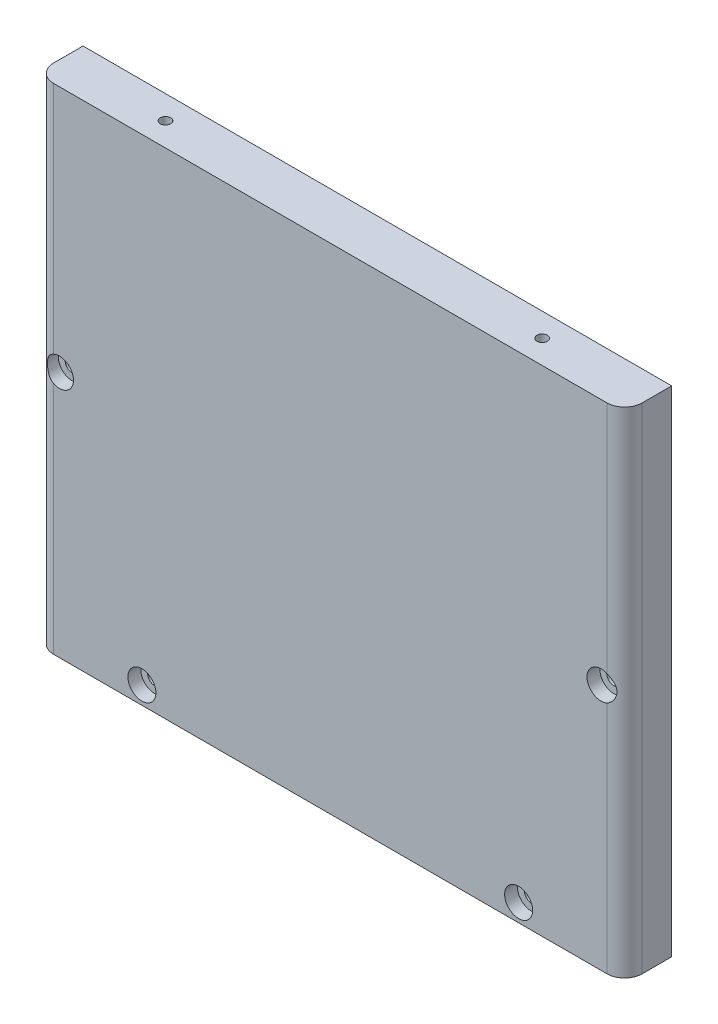
ISO-10303-21;
HEADER;
FILE_DESCRIPTION(('STEP AP214'),'2;1');
FILE_NAME('part.step','',(''),(''),'','','');
FILE_SCHEMA(('AUTOMOTIVE_DESIGN { 1 0 10303 214 1 1 1 1 }'));
ENDSEC;
DATA;
#1=APPLICATION_CONTEXT('core data for automotive mechanical design processes');
#2=APPLICATION_PROTOCOL_DEFINITION('international standard','automotive_design',2000,#1);
#3=PRODUCT_CONTEXT('',#1,'mechanical');
#4=PRODUCT('Part','Part','',(#3));
#5=PRODUCT_RELATED_PRODUCT_CATEGORY('part','',(#4));
#6=PRODUCT_DEFINITION_FORMATION('','',#4);
#7=PRODUCT_DEFINITION_CONTEXT('part definition',#1,'design');
#8=PRODUCT_DEFINITION('design','',#6,#7);
#9=PRODUCT_DEFINITION_SHAPE('','',#8);
#10=(LENGTH_UNIT() NAMED_UNIT(*) SI_UNIT(.MILLI.,.METRE.));
#11=(NAMED_UNIT(*) PLANE_ANGLE_UNIT() SI_UNIT($,.RADIAN.));
#12=(NAMED_UNIT(*) SI_UNIT($,.STERADIAN.) SOLID_ANGLE_UNIT());
#13=UNCERTAINTY_MEASURE_WITH_UNIT(LENGTH_MEASURE(1.E-05),#10,'distance_accuracy_value','');
#14=(GEOMETRIC_REPRESENTATION_CONTEXT(3) GLOBAL_UNCERTAINTY_ASSIGNED_CONTEXT((#13)) GLOBAL_UNIT_ASSIGNED_CONTEXT((#10,
#11,#12)) REPRESENTATION_CONTEXT('',''));
#15=CARTESIAN_POINT('',(0.,0.,0.));
#16=DIRECTION('',(0.,0.,1.));
#17=DIRECTION('',(1.,0.,0.));
#18=AXIS2_PLACEMENT_3D('',#15,#16,#17);
#19=CARTESIAN_POINT('',(50.,42.,8.));
#20=DIRECTION('',(-1.,0.,0.));
#21=DIRECTION('',(0.,0.,1.));
#22=AXIS2_PLACEMENT_3D('',#19,#20,#21);
#23=PLANE('',#22);
#24=DIRECTION('',(0.,0.,-1.));
#25=VECTOR('',#24,1.);
#26=CARTESIAN_POINT('',(50.,42.,8.));
#27=LINE('',#26,#25);
#28=CARTESIAN_POINT('',(50.,42.,5.));
#29=VERTEX_POINT('',#28);
#30=CARTESIAN_POINT('',(50.,42.,0.));
#31=VERTEX_POINT('',#30);
#32=EDGE_CURVE('E226',#29,#31,#27,.T.);
#33=ORIENTED_EDGE('',*,*,#32,.F.);
#34=DIRECTION('',(0.,1.,0.));
#35=VECTOR('',#34,1.);
#36=CARTESIAN_POINT('',(50.,-42.,5.));
#37=LINE('',#36,#35);
#38=CARTESIAN_POINT('',(50.,-42.,5.));
#39=VERTEX_POINT('',#38);
#40=EDGE_CURVE('E69',#29,#39,#37,.F.);
#41=ORIENTED_EDGE('',*,*,#40,.T.);
#42=DIRECTION('',(0.,0.,-1.));
#43=VECTOR('',#42,1.);
#44=CARTESIAN_POINT('',(50.,-42.,8.));
#45=LINE('',#44,#43);
#46=CARTESIAN_POINT('',(50.,-42.,0.));
#47=VERTEX_POINT('',#46);
#48=EDGE_CURVE('E202',#39,#47,#45,.T.);
#49=ORIENTED_EDGE('',*,*,#48,.T.);
#50=DIRECTION('',(0.,1.,0.));
#51=VECTOR('',#50,1.);
#52=CARTESIAN_POINT('',(50.,42.,0.));
#53=LINE('',#52,#51);
#54=EDGE_CURVE('E203',#47,#31,#53,.T.);
#55=ORIENTED_EDGE('',*,*,#54,.T.);
#56=EDGE_LOOP('',(#33,#41,#49,#55));
#57=FACE_BOUND('',#56,.T.);
#58=ADVANCED_FACE('F44',(#57),#23,.F.);
#59=CARTESIAN_POINT('',(-50.,42.,8.));
#60=DIRECTION('',(0.,-1.,0.));
#61=DIRECTION('',(0.,0.,-1.));
#62=AXIS2_PLACEMENT_3D('',#59,#60,#61);
#63=PLANE('',#62);
#64=CARTESIAN_POINT('',(-32.,42.,4.));
#65=DIRECTION('',(0.,1.,0.));
#66=DIRECTION('',(0.,0.,1.));
#67=AXIS2_PLACEMENT_3D('',#64,#65,#66);
#68=CIRCLE('',#67,0.888999999999997);
#69=CARTESIAN_POINT('',(-32.,42.,4.889));
#70=VERTEX_POINT('',#69);
#71=EDGE_CURVE('E128',#70,#70,#68,.T.);
#72=ORIENTED_EDGE('',*,*,#71,.F.);
#73=EDGE_LOOP('',(#72));
#74=FACE_BOUND('',#73,.T.);
#75=CARTESIAN_POINT('',(32.,42.,4.00000000000002));
#76=DIRECTION('',(0.,1.,0.));
#77=DIRECTION('',(0.,0.,1.));
#78=AXIS2_PLACEMENT_3D('',#75,#76,#77);
#79=CIRCLE('',#78,0.889000000000001);
#80=CARTESIAN_POINT('',(32.,42.,4.88900000000002));
#81=VERTEX_POINT('',#80);
#82=EDGE_CURVE('E127',#81,#81,#79,.T.);
#83=ORIENTED_EDGE('',*,*,#82,.F.);
#84=EDGE_LOOP('',(#83));
#85=FACE_BOUND('',#84,.T.);
#86=DIRECTION('',(-1.,0.,0.));
#87=VECTOR('',#86,1.);
#88=CARTESIAN_POINT('',(-50.,42.,8.));
#89=LINE('',#88,#87);
#90=CARTESIAN_POINT('',(47.,42.,8.));
#91=VERTEX_POINT('',#90);
#92=CARTESIAN_POINT('',(-47.,42.,8.));
#93=VERTEX_POINT('',#92);
#94=EDGE_CURVE('E193',#91,#93,#89,.T.);
#95=ORIENTED_EDGE('',*,*,#94,.F.);
#96=CARTESIAN_POINT('',(47.,42.,5.));
#97=DIRECTION('',(0.,-1.,0.));
#98=DIRECTION('',(0.,0.,-1.));
#99=AXIS2_PLACEMENT_3D('',#96,#97,#98);
#100=CIRCLE('',#99,3.);
#101=EDGE_CURVE('E336',#91,#29,#100,.F.);
#102=ORIENTED_EDGE('',*,*,#101,.T.);
#103=ORIENTED_EDGE('',*,*,#32,.T.);
#104=DIRECTION('',(-1.,0.,0.));
#105=VECTOR('',#104,1.);
#106=CARTESIAN_POINT('',(-50.,42.,0.));
#107=LINE('',#106,#105);
#108=CARTESIAN_POINT('',(-50.,42.,0.));
#109=VERTEX_POINT('',#108);
#110=EDGE_CURVE('E207',#31,#109,#107,.T.);
#111=ORIENTED_EDGE('',*,*,#110,.T.);
#112=DIRECTION('',(0.,0.,-1.));
#113=VECTOR('',#112,1.);
#114=CARTESIAN_POINT('',(-50.,42.,8.));
#115=LINE('',#114,#113);
#116=CARTESIAN_POINT('',(-50.,42.,5.));
#117=VERTEX_POINT('',#116);
#118=EDGE_CURVE('E223',#117,#109,#115,.T.);
#119=ORIENTED_EDGE('',*,*,#118,.F.);
#120=CARTESIAN_POINT('',(-47.,42.,5.));
#121=DIRECTION('',(0.,-1.,0.));
#122=DIRECTION('',(0.,0.,-1.));
#123=AXIS2_PLACEMENT_3D('',#120,#121,#122);
#124=CIRCLE('',#123,3.);
#125=EDGE_CURVE('E263',#117,#93,#124,.F.);
#126=ORIENTED_EDGE('',*,*,#125,.T.);
#127=EDGE_LOOP('',(#95,#102,#103,#111,#119,#126));
#128=FACE_BOUND('',#127,.T.);
#129=ADVANCED_FACE('F322',(#74,#85,#128),#63,.F.);
#130=CARTESIAN_POINT('',(-50.,42.,8.));
#131=DIRECTION('',(1.,0.,0.));
#132=DIRECTION('',(0.,0.,-1.));
#133=AXIS2_PLACEMENT_3D('',#130,#131,#132);
#134=PLANE('',#133);
#135=DIRECTION('',(0.,0.,-1.));
#136=VECTOR('',#135,1.);
#137=CARTESIAN_POINT('',(-50.,-42.,8.));
#138=LINE('',#137,#136);
#139=CARTESIAN_POINT('',(-50.,-42.,5.));
#140=VERTEX_POINT('',#139);
#141=CARTESIAN_POINT('',(-50.,-42.,0.));
#142=VERTEX_POINT('',#141);
#143=EDGE_CURVE('E220',#140,#142,#138,.T.);
#144=ORIENTED_EDGE('',*,*,#143,.F.);
#145=DIRECTION('',(0.,-1.,0.));
#146=VECTOR('',#145,1.);
#147=CARTESIAN_POINT('',(-50.,42.,5.));
#148=LINE('',#147,#146);
#149=EDGE_CURVE('E11',#140,#117,#148,.F.);
#150=ORIENTED_EDGE('',*,*,#149,.T.);
#151=ORIENTED_EDGE('',*,*,#118,.T.);
#152=DIRECTION('',(0.,-1.,0.));
#153=VECTOR('',#152,1.);
#154=CARTESIAN_POINT('',(-50.,42.,0.));
#155=LINE('',#154,#153);
#156=EDGE_CURVE('E211',#109,#142,#155,.T.);
#157=ORIENTED_EDGE('',*,*,#156,.T.);
#158=EDGE_LOOP('',(#144,#150,#151,#157));
#159=FACE_BOUND('',#158,.T.);
#160=ADVANCED_FACE('F319',(#159),#134,.F.);
#161=CARTESIAN_POINT('',(-50.,-42.,8.));
#162=DIRECTION('',(0.,1.,0.));
#163=DIRECTION('',(0.,0.,1.));
#164=AXIS2_PLACEMENT_3D('',#161,#162,#163);
#165=PLANE('',#164);
#166=ORIENTED_EDGE('',*,*,#48,.F.);
#167=CARTESIAN_POINT('',(47.,-42.,5.));
#168=DIRECTION('',(0.,1.,0.));
#169=DIRECTION('',(0.,0.,1.));
#170=AXIS2_PLACEMENT_3D('',#167,#168,#169);
#171=CIRCLE('',#170,3.);
#172=CARTESIAN_POINT('',(47.,-42.,8.));
#173=VERTEX_POINT('',#172);
#174=EDGE_CURVE('E338',#39,#173,#171,.F.);
#175=ORIENTED_EDGE('',*,*,#174,.T.);
#176=DIRECTION('',(1.,0.,0.));
#177=VECTOR('',#176,1.);
#178=CARTESIAN_POINT('',(-50.,-42.,8.));
#179=LINE('',#178,#177);
#180=CARTESIAN_POINT('',(-47.,-42.,8.));
#181=VERTEX_POINT('',#180);
#182=EDGE_CURVE('E197',#181,#173,#179,.T.);
#183=ORIENTED_EDGE('',*,*,#182,.F.);
#184=CARTESIAN_POINT('',(-47.,-42.,5.));
#185=DIRECTION('',(0.,1.,0.));
#186=DIRECTION('',(0.,0.,1.));
#187=AXIS2_PLACEMENT_3D('',#184,#185,#186);
#188=CIRCLE('',#187,3.);
#189=EDGE_CURVE('E61',#181,#140,#188,.F.);
#190=ORIENTED_EDGE('',*,*,#189,.T.);
#191=ORIENTED_EDGE('',*,*,#143,.T.);
#192=DIRECTION('',(1.,0.,0.));
#193=VECTOR('',#192,1.);
#194=CARTESIAN_POINT('',(-50.,-42.,0.));
#195=LINE('',#194,#193);
#196=EDGE_CURVE('E198',#142,#47,#195,.T.);
#197=ORIENTED_EDGE('',*,*,#196,.T.);
#198=EDGE_LOOP('',(#166,#175,#183,#190,#191,#197));
#199=FACE_BOUND('',#198,.T.);
#200=ADVANCED_FACE('F312',(#199),#165,.F.);
#201=CARTESIAN_POINT('',(0.,0.,8.));
#202=DIRECTION('',(0.,0.,1.));
#203=DIRECTION('',(1.,0.,0.));
#204=AXIS2_PLACEMENT_3D('',#201,#202,#203);
#205=PLANE('',#204);
#206=ORIENTED_EDGE('',*,*,#182,.T.);
#207=DIRECTION('',(0.,1.,0.));
#208=VECTOR('',#207,1.);
#209=CARTESIAN_POINT('',(47.,42.,8.));
#210=LINE('',#209,#208);
#211=CARTESIAN_POINT('',(47.,-2.16109961882834,8.));
#212=VERTEX_POINT('',#211);
#213=EDGE_CURVE('E251',#173,#212,#210,.T.);
#214=ORIENTED_EDGE('',*,*,#213,.T.);
#215=CARTESIAN_POINT('',(46.,0.,8.));
#216=DIRECTION('',(0.,0.,1.));
#217=DIRECTION('',(1.,0.,0.));
#218=AXIS2_PLACEMENT_3D('',#215,#216,#217);
#219=CIRCLE('',#218,2.38124999999999);
#220=CARTESIAN_POINT('',(47.,2.16109961882834,8.));
#221=VERTEX_POINT('',#220);
#222=EDGE_CURVE('E154',#221,#212,#219,.T.);
#223=ORIENTED_EDGE('',*,*,#222,.F.);
#224=DIRECTION('',(0.,1.,0.));
#225=VECTOR('',#224,1.);
#226=CARTESIAN_POINT('',(47.,42.,8.));
#227=LINE('',#226,#225);
#228=EDGE_CURVE('E248',#221,#91,#227,.T.);
#229=ORIENTED_EDGE('',*,*,#228,.T.);
#230=ORIENTED_EDGE('',*,*,#94,.T.);
#231=DIRECTION('',(0.,-1.,0.));
#232=VECTOR('',#231,1.);
#233=CARTESIAN_POINT('',(-47.,-42.,8.));
#234=LINE('',#233,#232);
#235=CARTESIAN_POINT('',(-47.,2.16109961882834,8.));
#236=VERTEX_POINT('',#235);
#237=EDGE_CURVE('E244',#93,#236,#234,.T.);
#238=ORIENTED_EDGE('',*,*,#237,.T.);
#239=CARTESIAN_POINT('',(-46.,0.,8.));
#240=DIRECTION('',(0.,0.,1.));
#241=DIRECTION('',(1.,0.,0.));
#242=AXIS2_PLACEMENT_3D('',#239,#240,#241);
#243=CIRCLE('',#242,2.38124999999999);
#244=CARTESIAN_POINT('',(-47.,-2.16109961882834,8.));
#245=VERTEX_POINT('',#244);
#246=EDGE_CURVE('E141',#245,#236,#243,.T.);
#247=ORIENTED_EDGE('',*,*,#246,.F.);
#248=DIRECTION('',(0.,-1.,0.));
#249=VECTOR('',#248,1.);
#250=CARTESIAN_POINT('',(-47.,-42.,8.));
#251=LINE('',#250,#249);
#252=EDGE_CURVE('E229',#245,#181,#251,.T.);
#253=ORIENTED_EDGE('',*,*,#252,.T.);
#254=EDGE_LOOP('',(#206,#214,#223,#229,#230,#238,#247,#253));
#255=FACE_BOUND('',#254,.T.);
#256=CARTESIAN_POINT('',(-32.,-39.,8.));
#257=DIRECTION('',(0.,0.,1.));
#258=DIRECTION('',(1.,0.,0.));
#259=AXIS2_PLACEMENT_3D('',#256,#257,#258);
#260=CIRCLE('',#259,2.38125);
#261=CARTESIAN_POINT('',(-29.61875,-39.,8.));
#262=VERTEX_POINT('',#261);
#263=EDGE_CURVE('E167',#262,#262,#260,.T.);
#264=ORIENTED_EDGE('',*,*,#263,.F.);
#265=EDGE_LOOP('',(#264));
#266=FACE_BOUND('',#265,.T.);
#267=CARTESIAN_POINT('',(32.,-39.,8.));
#268=DIRECTION('',(0.,0.,1.));
#269=DIRECTION('',(1.,0.,0.));
#270=AXIS2_PLACEMENT_3D('',#267,#268,#269);
#271=CIRCLE('',#270,2.38125);
#272=CARTESIAN_POINT('',(34.38125,-39.,8.));
#273=VERTEX_POINT('',#272);
#274=EDGE_CURVE('E180',#273,#273,#271,.T.);
#275=ORIENTED_EDGE('',*,*,#274,.F.);
#276=EDGE_LOOP('',(#275));
#277=FACE_BOUND('',#276,.T.);
#278=ADVANCED_FACE('F309',(#255,#266,#277),#205,.T.);
#279=CARTESIAN_POINT('',(0.,0.,0.));
#280=DIRECTION('',(0.,0.,1.));
#281=DIRECTION('',(1.,0.,0.));
#282=AXIS2_PLACEMENT_3D('',#279,#280,#281);
#283=PLANE('',#282);
#284=CARTESIAN_POINT('',(-46.,0.,0.));
#285=DIRECTION('',(0.,0.,1.));
#286=DIRECTION('',(1.,0.,0.));
#287=AXIS2_PLACEMENT_3D('',#284,#285,#286);
#288=CIRCLE('',#287,1.2192);
#289=CARTESIAN_POINT('',(-44.7808,0.,0.));
#290=VERTEX_POINT('',#289);
#291=EDGE_CURVE('E153',#290,#290,#288,.T.);
#292=ORIENTED_EDGE('',*,*,#291,.T.);
#293=EDGE_LOOP('',(#292));
#294=FACE_BOUND('',#293,.T.);
#295=CARTESIAN_POINT('',(46.,0.,0.));
#296=DIRECTION('',(0.,0.,1.));
#297=DIRECTION('',(1.,0.,0.));
#298=AXIS2_PLACEMENT_3D('',#295,#296,#297);
#299=CIRCLE('',#298,1.2192);
#300=CARTESIAN_POINT('',(47.2192,0.,0.));
#301=VERTEX_POINT('',#300);
#302=EDGE_CURVE('E166',#301,#301,#299,.T.);
#303=ORIENTED_EDGE('',*,*,#302,.T.);
#304=EDGE_LOOP('',(#303));
#305=FACE_BOUND('',#304,.T.);
#306=CARTESIAN_POINT('',(-32.,-39.,0.));
#307=DIRECTION('',(0.,0.,1.));
#308=DIRECTION('',(1.,0.,0.));
#309=AXIS2_PLACEMENT_3D('',#306,#307,#308);
#310=CIRCLE('',#309,1.2192);
#311=CARTESIAN_POINT('',(-30.7808,-39.,0.));
#312=VERTEX_POINT('',#311);
#313=EDGE_CURVE('E179',#312,#312,#310,.T.);
#314=ORIENTED_EDGE('',*,*,#313,.T.);
#315=EDGE_LOOP('',(#314));
#316=FACE_BOUND('',#315,.T.);
#317=CARTESIAN_POINT('',(32.,-39.,0.));
#318=DIRECTION('',(0.,0.,1.));
#319=DIRECTION('',(1.,0.,0.));
#320=AXIS2_PLACEMENT_3D('',#317,#318,#319);
#321=CIRCLE('',#320,1.2192);
#322=CARTESIAN_POINT('',(33.2192,-39.,0.));
#323=VERTEX_POINT('',#322);
#324=EDGE_CURVE('E192',#323,#323,#321,.T.);
#325=ORIENTED_EDGE('',*,*,#324,.T.);
#326=EDGE_LOOP('',(#325));
#327=FACE_BOUND('',#326,.T.);
#328=ORIENTED_EDGE('',*,*,#54,.F.);
#329=ORIENTED_EDGE('',*,*,#196,.F.);
#330=ORIENTED_EDGE('',*,*,#156,.F.);
#331=ORIENTED_EDGE('',*,*,#110,.F.);
#332=EDGE_LOOP('',(#328,#329,#330,#331));
#333=FACE_BOUND('',#332,.T.);
#334=ADVANCED_FACE('F307',(#294,#305,#316,#327,#333),#283,.F.);
#335=CARTESIAN_POINT('',(32.,-39.,8.));
#336=DIRECTION('',(0.,0.,1.));
#337=DIRECTION('',(1.,0.,0.));
#338=AXIS2_PLACEMENT_3D('',#335,#336,#337);
#339=CYLINDRICAL_SURFACE('',#338,1.2192);
#340=CARTESIAN_POINT('',(32.,-39.,5.8156));
#341=DIRECTION('',(0.,0.,1.));
#342=DIRECTION('',(1.,0.,0.));
#343=AXIS2_PLACEMENT_3D('',#340,#341,#342);
#344=CIRCLE('',#343,1.2192);
#345=CARTESIAN_POINT('',(33.2192,-39.,5.8156));
#346=VERTEX_POINT('',#345);
#347=EDGE_CURVE('E188',#346,#346,#344,.T.);
#348=ORIENTED_EDGE('',*,*,#347,.T.);
#349=EDGE_LOOP('',(#348));
#350=FACE_BOUND('',#349,.T.);
#351=ORIENTED_EDGE('',*,*,#324,.F.);
#352=EDGE_LOOP('',(#351));
#353=FACE_BOUND('',#352,.T.);
#354=ADVANCED_FACE('F303',(#350,#353),#339,.F.);
#355=CARTESIAN_POINT('',(33.2192,-39.,5.8156));
#356=DIRECTION('',(0.,0.,-1.));
#357=DIRECTION('',(-1.,0.,0.));
#358=AXIS2_PLACEMENT_3D('',#355,#356,#357);
#359=PLANE('',#358);
#360=ORIENTED_EDGE('',*,*,#347,.F.);
#361=EDGE_LOOP('',(#360));
#362=FACE_BOUND('',#361,.T.);
#363=CARTESIAN_POINT('',(32.,-39.,5.8156));
#364=DIRECTION('',(0.,0.,1.));
#365=DIRECTION('',(1.,0.,0.));
#366=AXIS2_PLACEMENT_3D('',#363,#364,#365);
#367=CIRCLE('',#366,2.38125);
#368=CARTESIAN_POINT('',(34.38125,-39.,5.8156));
#369=VERTEX_POINT('',#368);
#370=EDGE_CURVE('E184',#369,#369,#367,.T.);
#371=ORIENTED_EDGE('',*,*,#370,.T.);
#372=EDGE_LOOP('',(#371));
#373=FACE_BOUND('',#372,.T.);
#374=ADVANCED_FACE('F299',(#362,#373),#359,.F.);
#375=CARTESIAN_POINT('',(32.,-39.,8.));
#376=DIRECTION('',(0.,0.,1.));
#377=DIRECTION('',(1.,0.,0.));
#378=AXIS2_PLACEMENT_3D('',#375,#376,#377);
#379=CYLINDRICAL_SURFACE('',#378,2.38125);
#380=ORIENTED_EDGE('',*,*,#370,.F.);
#381=EDGE_LOOP('',(#380));
#382=FACE_BOUND('',#381,.T.);
#383=ORIENTED_EDGE('',*,*,#274,.T.);
#384=EDGE_LOOP('',(#383));
#385=FACE_BOUND('',#384,.T.);
#386=ADVANCED_FACE('F295',(#382,#385),#379,.F.);
#387=CARTESIAN_POINT('',(-32.,-39.,8.));
#388=DIRECTION('',(0.,0.,1.));
#389=DIRECTION('',(1.,0.,0.));
#390=AXIS2_PLACEMENT_3D('',#387,#388,#389);
#391=CYLINDRICAL_SURFACE('',#390,1.2192);
#392=CARTESIAN_POINT('',(-32.,-39.,5.8156));
#393=DIRECTION('',(0.,0.,1.));
#394=DIRECTION('',(1.,0.,0.));
#395=AXIS2_PLACEMENT_3D('',#392,#393,#394);
#396=CIRCLE('',#395,1.2192);
#397=CARTESIAN_POINT('',(-30.7808,-39.,5.8156));
#398=VERTEX_POINT('',#397);
#399=EDGE_CURVE('E175',#398,#398,#396,.T.);
#400=ORIENTED_EDGE('',*,*,#399,.T.);
#401=EDGE_LOOP('',(#400));
#402=FACE_BOUND('',#401,.T.);
#403=ORIENTED_EDGE('',*,*,#313,.F.);
#404=EDGE_LOOP('',(#403));
#405=FACE_BOUND('',#404,.T.);
#406=ADVANCED_FACE('F291',(#402,#405),#391,.F.);
#407=CARTESIAN_POINT('',(-30.7808,-39.,5.8156));
#408=DIRECTION('',(0.,0.,-1.));
#409=DIRECTION('',(-1.,0.,0.));
#410=AXIS2_PLACEMENT_3D('',#407,#408,#409);
#411=PLANE('',#410);
#412=ORIENTED_EDGE('',*,*,#399,.F.);
#413=EDGE_LOOP('',(#412));
#414=FACE_BOUND('',#413,.T.);
#415=CARTESIAN_POINT('',(-32.,-39.,5.8156));
#416=DIRECTION('',(0.,0.,1.));
#417=DIRECTION('',(1.,0.,0.));
#418=AXIS2_PLACEMENT_3D('',#415,#416,#417);
#419=CIRCLE('',#418,2.38125);
#420=CARTESIAN_POINT('',(-29.61875,-39.,5.8156));
#421=VERTEX_POINT('',#420);
#422=EDGE_CURVE('E171',#421,#421,#419,.T.);
#423=ORIENTED_EDGE('',*,*,#422,.T.);
#424=EDGE_LOOP('',(#423));
#425=FACE_BOUND('',#424,.T.);
#426=ADVANCED_FACE('F287',(#414,#425),#411,.F.);
#427=CARTESIAN_POINT('',(-32.,-39.,8.));
#428=DIRECTION('',(0.,0.,1.));
#429=DIRECTION('',(1.,0.,0.));
#430=AXIS2_PLACEMENT_3D('',#427,#428,#429);
#431=CYLINDRICAL_SURFACE('',#430,2.38125);
#432=ORIENTED_EDGE('',*,*,#422,.F.);
#433=EDGE_LOOP('',(#432));
#434=FACE_BOUND('',#433,.T.);
#435=ORIENTED_EDGE('',*,*,#263,.T.);
#436=EDGE_LOOP('',(#435));
#437=FACE_BOUND('',#436,.T.);
#438=ADVANCED_FACE('F283',(#434,#437),#431,.F.);
#439=CARTESIAN_POINT('',(46.,0.,8.));
#440=DIRECTION('',(0.,0.,1.));
#441=DIRECTION('',(1.,0.,0.));
#442=AXIS2_PLACEMENT_3D('',#439,#440,#441);
#443=CYLINDRICAL_SURFACE('',#442,1.2192);
#444=CARTESIAN_POINT('',(46.,0.,5.8156));
#445=DIRECTION('',(0.,0.,1.));
#446=DIRECTION('',(1.,0.,0.));
#447=AXIS2_PLACEMENT_3D('',#444,#445,#446);
#448=CIRCLE('',#447,1.2192);
#449=CARTESIAN_POINT('',(47.2192,0.,5.8156));
#450=VERTEX_POINT('',#449);
#451=EDGE_CURVE('E162',#450,#450,#448,.T.);
#452=ORIENTED_EDGE('',*,*,#451,.T.);
#453=EDGE_LOOP('',(#452));
#454=FACE_BOUND('',#453,.T.);
#455=ORIENTED_EDGE('',*,*,#302,.F.);
#456=EDGE_LOOP('',(#455));
#457=FACE_BOUND('',#456,.T.);
#458=ADVANCED_FACE('F279',(#454,#457),#443,.F.);
#459=CARTESIAN_POINT('',(47.2192,0.,5.8156));
#460=DIRECTION('',(0.,0.,-1.));
#461=DIRECTION('',(-1.,0.,0.));
#462=AXIS2_PLACEMENT_3D('',#459,#460,#461);
#463=PLANE('',#462);
#464=ORIENTED_EDGE('',*,*,#451,.F.);
#465=EDGE_LOOP('',(#464));
#466=FACE_BOUND('',#465,.T.);
#467=CARTESIAN_POINT('',(46.,0.,5.8156));
#468=DIRECTION('',(0.,0.,1.));
#469=DIRECTION('',(1.,0.,0.));
#470=AXIS2_PLACEMENT_3D('',#467,#468,#469);
#471=CIRCLE('',#470,2.38124999999999);
#472=CARTESIAN_POINT('',(48.38125,0.,5.8156));
#473=VERTEX_POINT('',#472);
#474=EDGE_CURVE('E158',#473,#473,#471,.T.);
#475=ORIENTED_EDGE('',*,*,#474,.T.);
#476=EDGE_LOOP('',(#475));
#477=FACE_BOUND('',#476,.T.);
#478=ADVANCED_FACE('F274',(#466,#477),#463,.F.);
#479=CARTESIAN_POINT('',(46.,0.,8.));
#480=DIRECTION('',(0.,0.,1.));
#481=DIRECTION('',(1.,0.,0.));
#482=AXIS2_PLACEMENT_3D('',#479,#480,#481);
#483=CYLINDRICAL_SURFACE('',#482,2.38124999999999);
#484=ORIENTED_EDGE('',*,*,#474,.F.);
#485=EDGE_LOOP('',(#484));
#486=FACE_BOUND('',#485,.T.);
#487=ORIENTED_EDGE('',*,*,#222,.T.);
#488=CARTESIAN_POINT('',(47.,-2.16109961882834,8.));
#489=CARTESIAN_POINT('',(47.0579695527219,-2.13428783693508,8.00000909989603));
#490=CARTESIAN_POINT('',(47.1148255937347,-2.1051357742075,7.99832023465691));
#491=CARTESIAN_POINT('',(47.2258432791018,-2.04247504529154,7.99200068778509));
#492=CARTESIAN_POINT('',(47.280007529284,-2.00897071062508,7.98737291347562));
#493=CARTESIAN_POINT('',(47.385004487466,-1.93806834168236,7.97565979249706));
#494=CARTESIAN_POINT('',(47.4358536923646,-1.90069244373514,7.96858793023407));
#495=CARTESIAN_POINT('',(47.5342406132931,-1.82220240667942,7.95246915779541));
#496=CARTESIAN_POINT('',(47.581777547478,-1.78108739021478,7.94342178337932));
#497=CARTESIAN_POINT('',(47.7187058699667,-1.65287003666657,7.91412762798694));
#498=CARTESIAN_POINT('',(47.8028699911998,-1.56058604244701,7.89167005006715));
#499=CARTESIAN_POINT('',(47.9556977541701,-1.36423445282908,7.84483058913338));
#500=CARTESIAN_POINT('',(48.0243311483909,-1.26014444576803,7.8204450737625));
#501=CARTESIAN_POINT('',(48.1498319791845,-1.03286156193422,7.77178572642309));
#502=CARTESIAN_POINT('',(48.2052092359227,-0.908797346736459,7.74769651941434));
#503=CARTESIAN_POINT('',(48.2942570133091,-0.652038905220005,7.70690414296779));
#504=CARTESIAN_POINT('',(48.3279537896519,-0.519355332507291,7.69019204736544));
#505=CARTESIAN_POINT('',(48.3711169888111,-0.255357666514728,7.66844739323498));
#506=CARTESIAN_POINT('',(48.3816168059123,-0.124256291123194,7.66291769048884));
#507=CARTESIAN_POINT('',(48.3808638137944,0.137843149853899,7.66330994481735));
#508=CARTESIAN_POINT('',(48.3696173195886,0.268841234383235,7.66922857735645));
#509=CARTESIAN_POINT('',(48.327919604594,0.515170455120423,7.69018422208746));
#510=CARTESIAN_POINT('',(48.2992101779711,0.630877797080772,7.70438991867944));
#511=CARTESIAN_POINT('',(48.2252351969977,0.855998228089096,7.73869519448261));
#512=CARTESIAN_POINT('',(48.1799565042207,0.965406242253724,7.75879944837848));
#513=CARTESIAN_POINT('',(48.0697677142396,1.18432436812082,7.80346278628379));
#514=CARTESIAN_POINT('',(48.0035754281187,1.29314038238705,7.82824973521766));
#515=CARTESIAN_POINT('',(47.8546067803348,1.49896211391126,7.87676200228146));
#516=CARTESIAN_POINT('',(47.7718456178284,1.5959785251552,7.90048826918414));
#517=CARTESIAN_POINT('',(47.6328537365217,1.73461468845985,7.93291782723446));
#518=CARTESIAN_POINT('',(47.5819224995816,1.78119421944385,7.94351241260936));
#519=CARTESIAN_POINT('',(47.4759583237245,1.86993863518107,7.9624920037273));
#520=CARTESIAN_POINT('',(47.4209263361893,1.91210453847879,7.97087751994357));
#521=CARTESIAN_POINT('',(47.3068125189376,1.99184821184116,7.98482531031975));
#522=CARTESIAN_POINT('',(47.2477094826052,2.02939859203754,7.99037129584207));
#523=CARTESIAN_POINT('',(47.1261921414664,2.09928126796791,7.99796717461058));
#524=CARTESIAN_POINT('',(47.0637738959922,2.13160716037478,8.00001280668119));
#525=CARTESIAN_POINT('',(47.,2.16109961882834,8.));
#526=B_SPLINE_CURVE_WITH_KNOTS('',3,(#488,#489,#490,#491,#492,#493,#494,#495,#496,#497,#498,
#499,#500,#501,#502,#503,#504,#505,#506,#507,#508,#509,#510,#511,#512,#513,#514,#515,#516,#517,
#518,#519,#520,#521,#522,#523,#524,#525),.UNSPECIFIED.,.F.,.F.,(4,2,2,2,2,2,2,2,2,2,2,2,2,2,2,2,
2,2,4),(0.,0.191493035458305,0.382796930410659,0.573061790528122,0.763371410627202,
1.1423502042429,1.52206086009184,1.93395282616735,2.345345035468,2.73800579809355,
3.13055255124485,3.48921015895702,3.84815277890414,4.23585313998039,4.62319946750654,
4.83243502650714,5.04162219271345,5.25199625798188,5.46262624162081),.UNSPECIFIED.);
#527=EDGE_CURVE('E255',#212,#221,#526,.T.);
#528=ORIENTED_EDGE('',*,*,#527,.T.);
#529=EDGE_LOOP('',(#487,#528));
#530=FACE_BOUND('',#529,.T.);
#531=ADVANCED_FACE('F268',(#486,#530),#483,.F.);
#532=CARTESIAN_POINT('',(-46.,0.,8.));
#533=DIRECTION('',(0.,0.,1.));
#534=DIRECTION('',(1.,0.,0.));
#535=AXIS2_PLACEMENT_3D('',#532,#533,#534);
#536=CYLINDRICAL_SURFACE('',#535,1.2192);
#537=CARTESIAN_POINT('',(-46.,0.,5.8156));
#538=DIRECTION('',(0.,0.,1.));
#539=DIRECTION('',(1.,0.,0.));
#540=AXIS2_PLACEMENT_3D('',#537,#538,#539);
#541=CIRCLE('',#540,1.2192);
#542=CARTESIAN_POINT('',(-44.7808,0.,5.8156));
#543=VERTEX_POINT('',#542);
#544=EDGE_CURVE('E149',#543,#543,#541,.T.);
#545=ORIENTED_EDGE('',*,*,#544,.T.);
#546=EDGE_LOOP('',(#545));
#547=FACE_BOUND('',#546,.T.);
#548=ORIENTED_EDGE('',*,*,#291,.F.);
#549=EDGE_LOOP('',(#548));
#550=FACE_BOUND('',#549,.T.);
#551=ADVANCED_FACE('F273',(#547,#550),#536,.F.);
#552=CARTESIAN_POINT('',(-44.7808,0.,5.8156));
#553=DIRECTION('',(0.,0.,-1.));
#554=DIRECTION('',(-1.,0.,0.));
#555=AXIS2_PLACEMENT_3D('',#552,#553,#554);
#556=PLANE('',#555);
#557=ORIENTED_EDGE('',*,*,#544,.F.);
#558=EDGE_LOOP('',(#557));
#559=FACE_BOUND('',#558,.T.);
#560=CARTESIAN_POINT('',(-46.,0.,5.8156));
#561=DIRECTION('',(0.,0.,1.));
#562=DIRECTION('',(1.,0.,0.));
#563=AXIS2_PLACEMENT_3D('',#560,#561,#562);
#564=CIRCLE('',#563,2.38124999999999);
#565=CARTESIAN_POINT('',(-43.61875,0.,5.8156));
#566=VERTEX_POINT('',#565);
#567=EDGE_CURVE('E145',#566,#566,#564,.T.);
#568=ORIENTED_EDGE('',*,*,#567,.T.);
#569=EDGE_LOOP('',(#568));
#570=FACE_BOUND('',#569,.T.);
#571=ADVANCED_FACE('F357',(#559,#570),#556,.F.);
#572=CARTESIAN_POINT('',(-46.,0.,8.));
#573=DIRECTION('',(0.,0.,1.));
#574=DIRECTION('',(1.,0.,0.));
#575=AXIS2_PLACEMENT_3D('',#572,#573,#574);
#576=CYLINDRICAL_SURFACE('',#575,2.38124999999999);
#577=ORIENTED_EDGE('',*,*,#567,.F.);
#578=EDGE_LOOP('',(#577));
#579=FACE_BOUND('',#578,.T.);
#580=ORIENTED_EDGE('',*,*,#246,.T.);
#581=CARTESIAN_POINT('',(-47.,2.16109961882834,8.));
#582=CARTESIAN_POINT('',(-47.0579695527219,2.13428783693508,8.00000909989603));
#583=CARTESIAN_POINT('',(-47.1148255937347,2.1051357742075,7.99832023465691));
#584=CARTESIAN_POINT('',(-47.2258432791018,2.04247504529154,7.99200068778509));
#585=CARTESIAN_POINT('',(-47.280007529284,2.00897071062508,7.98737291347562));
#586=CARTESIAN_POINT('',(-47.385004487466,1.93806834168236,7.97565979249706));
#587=CARTESIAN_POINT('',(-47.4358536923646,1.90069244373514,7.96858793023406));
#588=CARTESIAN_POINT('',(-47.5342406132931,1.82220240667942,7.95246915779541));
#589=CARTESIAN_POINT('',(-47.581777547478,1.78108739021478,7.94342178337932));
#590=CARTESIAN_POINT('',(-47.7187058699667,1.65287003666657,7.91412762798694));
#591=CARTESIAN_POINT('',(-47.8028699911998,1.56058604244701,7.89167005006714));
#592=CARTESIAN_POINT('',(-47.9556977541701,1.36423445282908,7.84483058913338));
#593=CARTESIAN_POINT('',(-48.0243311483909,1.26014444576803,7.8204450737625));
#594=CARTESIAN_POINT('',(-48.1498319791845,1.03286156193422,7.77178572642309));
#595=CARTESIAN_POINT('',(-48.2052092359226,0.908797346736457,7.74769651941434));
#596=CARTESIAN_POINT('',(-48.2942570133091,0.652038905220004,7.7069041429678));
#597=CARTESIAN_POINT('',(-48.3279537896519,0.51935533250729,7.69019204736544));
#598=CARTESIAN_POINT('',(-48.3711169888111,0.255357666514728,7.66844739323498));
#599=CARTESIAN_POINT('',(-48.3816168059123,0.124256291123194,7.66291769048884));
#600=CARTESIAN_POINT('',(-48.3808638137944,-0.137843149853899,7.66330994481735));
#601=CARTESIAN_POINT('',(-48.3696173195886,-0.268841234383235,7.66922857735645));
#602=CARTESIAN_POINT('',(-48.327919604594,-0.515170455120424,7.69018422208746));
#603=CARTESIAN_POINT('',(-48.2992101779711,-0.630877797080774,7.70438991867944));
#604=CARTESIAN_POINT('',(-48.2252351969977,-0.855998228089098,7.73869519448261));
#605=CARTESIAN_POINT('',(-48.1799565042207,-0.965406242253724,7.75879944837848));
#606=CARTESIAN_POINT('',(-48.0697677142396,-1.18432436812082,7.80346278628379));
#607=CARTESIAN_POINT('',(-48.0035754281187,-1.29314038238705,7.82824973521766));
#608=CARTESIAN_POINT('',(-47.8546067803348,-1.49896211391126,7.87676200228146));
#609=CARTESIAN_POINT('',(-47.7718456178284,-1.5959785251552,7.90048826918414));
#610=CARTESIAN_POINT('',(-47.6328537365217,-1.73461468845985,7.93291782723446));
#611=CARTESIAN_POINT('',(-47.5819224995816,-1.78119421944385,7.94351241260936));
#612=CARTESIAN_POINT('',(-47.4759583237245,-1.86993863518107,7.9624920037273));
#613=CARTESIAN_POINT('',(-47.4209263361893,-1.91210453847879,7.97087751994357));
#614=CARTESIAN_POINT('',(-47.3068125189376,-1.99184821184116,7.98482531031975));
#615=CARTESIAN_POINT('',(-47.2477094826052,-2.02939859203754,7.99037129584207));
#616=CARTESIAN_POINT('',(-47.1261921414664,-2.09928126796792,7.99796717461058));
#617=CARTESIAN_POINT('',(-47.0637738959922,-2.13160716037478,8.00001280668119));
#618=CARTESIAN_POINT('',(-47.,-2.16109961882834,8.));
#619=B_SPLINE_CURVE_WITH_KNOTS('',3,(#581,#582,#583,#584,#585,#586,#587,#588,#589,#590,#591,
#592,#593,#594,#595,#596,#597,#598,#599,#600,#601,#602,#603,#604,#605,#606,#607,#608,#609,#610,
#611,#612,#613,#614,#615,#616,#617,#618),.UNSPECIFIED.,.F.,.F.,(4,2,2,2,2,2,2,2,2,2,2,2,2,2,2,2,
2,2,4),(0.,0.191493035458313,0.382796930410659,0.573061790528129,0.763371410627202,
1.14235020424291,1.52206086009184,1.93395282616735,2.345345035468,2.73800579809355,
3.13055255124485,3.48921015895702,3.84815277890414,4.23585313998039,4.62319946750654,
4.83243502650713,5.04162219271345,5.25199625798189,5.46262624162081),.UNSPECIFIED.);
#620=EDGE_CURVE('E54',#236,#245,#619,.T.);
#621=ORIENTED_EDGE('',*,*,#620,.T.);
#622=EDGE_LOOP('',(#580,#621));
#623=FACE_BOUND('',#622,.T.);
#624=ADVANCED_FACE('F352',(#579,#623),#576,.F.);
#625=CARTESIAN_POINT('',(32.,30.,4.00000000000002));
#626=DIRECTION('',(0.,1.,0.));
#627=DIRECTION('',(0.,0.,1.));
#628=AXIS2_PLACEMENT_3D('',#625,#626,#627);
#629=CONICAL_SURFACE('',#628,0.889000000000001,1.02974425867665);
#630=CARTESIAN_POINT('',(32.,29.4658349096845,4.00000000000002));
#631=VERTEX_POINT('',#630);
#632=VERTEX_LOOP('',#631);
#633=FACE_BOUND('',#632,.T.);
#634=CARTESIAN_POINT('',(32.,30.,4.00000000000002));
#635=DIRECTION('',(0.,1.,0.));
#636=DIRECTION('',(0.,0.,1.));
#637=AXIS2_PLACEMENT_3D('',#634,#635,#636);
#638=CIRCLE('',#637,0.889000000000001);
#639=CARTESIAN_POINT('',(32.,30.,4.88900000000002));
#640=VERTEX_POINT('',#639);
#641=EDGE_CURVE('E133',#640,#640,#638,.T.);
#642=ORIENTED_EDGE('',*,*,#641,.T.);
#643=EDGE_LOOP('',(#642));
#644=FACE_BOUND('',#643,.T.);
#645=ADVANCED_FACE('F356',(#633,#644),#629,.F.);
#646=CARTESIAN_POINT('',(32.,42.,4.00000000000002));
#647=DIRECTION('',(0.,1.,0.));
#648=DIRECTION('',(0.,0.,1.));
#649=AXIS2_PLACEMENT_3D('',#646,#647,#648);
#650=CYLINDRICAL_SURFACE('',#649,0.889000000000001);
#651=ORIENTED_EDGE('',*,*,#641,.F.);
#652=EDGE_LOOP('',(#651));
#653=FACE_BOUND('',#652,.T.);
#654=ORIENTED_EDGE('',*,*,#82,.T.);
#655=EDGE_LOOP('',(#654));
#656=FACE_BOUND('',#655,.T.);
#657=ADVANCED_FACE('F120',(#653,#656),#650,.F.);
#658=CARTESIAN_POINT('',(-32.,30.,4.));
#659=DIRECTION('',(0.,1.,0.));
#660=DIRECTION('',(0.,0.,1.));
#661=AXIS2_PLACEMENT_3D('',#658,#659,#660);
#662=CONICAL_SURFACE('',#661,0.888999999999997,1.02974425867665);
#663=CARTESIAN_POINT('',(-32.,29.4658349096845,4.));
#664=VERTEX_POINT('',#663);
#665=VERTEX_LOOP('',#664);
#666=FACE_BOUND('',#665,.T.);
#667=CARTESIAN_POINT('',(-32.,30.,4.));
#668=DIRECTION('',(0.,1.,0.));
#669=DIRECTION('',(0.,0.,1.));
#670=AXIS2_PLACEMENT_3D('',#667,#668,#669);
#671=CIRCLE('',#670,0.888999999999997);
#672=CARTESIAN_POINT('',(-32.,30.,4.889));
#673=VERTEX_POINT('',#672);
#674=EDGE_CURVE('E124',#673,#673,#671,.T.);
#675=ORIENTED_EDGE('',*,*,#674,.T.);
#676=EDGE_LOOP('',(#675));
#677=FACE_BOUND('',#676,.T.);
#678=ADVANCED_FACE('F116',(#666,#677),#662,.F.);
#679=CARTESIAN_POINT('',(-32.,42.,4.));
#680=DIRECTION('',(0.,1.,0.));
#681=DIRECTION('',(0.,0.,1.));
#682=AXIS2_PLACEMENT_3D('',#679,#680,#681);
#683=CYLINDRICAL_SURFACE('',#682,0.888999999999997);
#684=ORIENTED_EDGE('',*,*,#674,.F.);
#685=EDGE_LOOP('',(#684));
#686=FACE_BOUND('',#685,.T.);
#687=ORIENTED_EDGE('',*,*,#71,.T.);
#688=EDGE_LOOP('',(#687));
#689=FACE_BOUND('',#688,.T.);
#690=ADVANCED_FACE('F119',(#686,#689),#683,.F.);
#691=CARTESIAN_POINT('',(47.,0.,5.));
#692=DIRECTION('',(0.,-1.,0.));
#693=DIRECTION('',(0.,0.,-1.));
#694=AXIS2_PLACEMENT_3D('',#691,#692,#693);
#695=CYLINDRICAL_SURFACE('',#694,3.);
#696=ORIENTED_EDGE('',*,*,#174,.F.);
#697=ORIENTED_EDGE('',*,*,#40,.F.);
#698=ORIENTED_EDGE('',*,*,#101,.F.);
#699=ORIENTED_EDGE('',*,*,#228,.F.);
#700=ORIENTED_EDGE('',*,*,#527,.F.);
#701=ORIENTED_EDGE('',*,*,#213,.F.);
#702=EDGE_LOOP('',(#696,#697,#698,#699,#700,#701));
#703=FACE_BOUND('',#702,.T.);
#704=ADVANCED_FACE('F265',(#703),#695,.T.);
#705=CARTESIAN_POINT('',(-47.,0.,5.));
#706=DIRECTION('',(0.,1.,0.));
#707=DIRECTION('',(0.,0.,1.));
#708=AXIS2_PLACEMENT_3D('',#705,#706,#707);
#709=CYLINDRICAL_SURFACE('',#708,3.);
#710=ORIENTED_EDGE('',*,*,#125,.F.);
#711=ORIENTED_EDGE('',*,*,#149,.F.);
#712=ORIENTED_EDGE('',*,*,#189,.F.);
#713=ORIENTED_EDGE('',*,*,#252,.F.);
#714=ORIENTED_EDGE('',*,*,#620,.F.);
#715=ORIENTED_EDGE('',*,*,#237,.F.);
#716=EDGE_LOOP('',(#710,#711,#712,#713,#714,#715));
#717=FACE_BOUND('',#716,.T.);
#718=ADVANCED_FACE('F46',(#717),#709,.T.);
#719=CLOSED_SHELL('',(#58,#129,#160,#200,#278,#334,#354,#374,#386,#406,#426,#438,#458,#478,#531,
#551,#571,#624,#645,#657,#678,#690,#704,#718));
#720=MANIFOLD_SOLID_BREP('B2',#719);
#721=ADVANCED_BREP_SHAPE_REPRESENTATION('',(#18,#720),#14);
#722=SHAPE_DEFINITION_REPRESENTATION(#9,#721);
ENDSEC;
END-ISO-10303-21;
